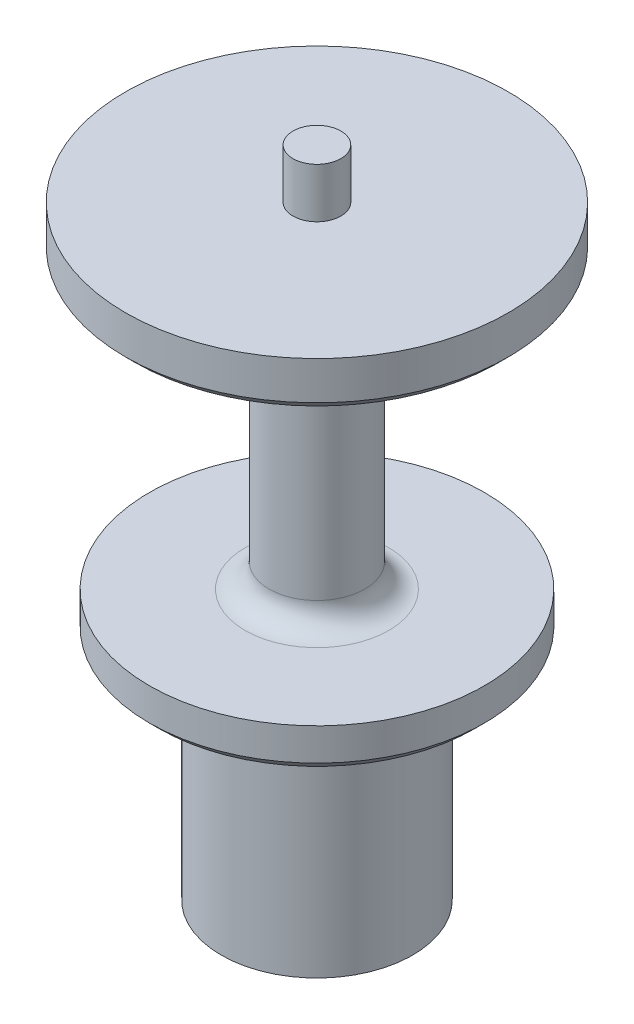
ISO-10303-21;
HEADER;
FILE_DESCRIPTION(('STEP AP214'),'2;1');
FILE_NAME('part.step','',(''),(''),'','','');
FILE_SCHEMA(('AUTOMOTIVE_DESIGN { 1 0 10303 214 1 1 1 1 }'));
ENDSEC;
DATA;
#1=APPLICATION_CONTEXT('core data for automotive mechanical design processes');
#2=APPLICATION_PROTOCOL_DEFINITION('international standard','automotive_design',2000,#1);
#3=PRODUCT_CONTEXT('',#1,'mechanical');
#4=PRODUCT('Part','Part','',(#3));
#5=PRODUCT_RELATED_PRODUCT_CATEGORY('part','',(#4));
#6=PRODUCT_DEFINITION_FORMATION('','',#4);
#7=PRODUCT_DEFINITION_CONTEXT('part definition',#1,'design');
#8=PRODUCT_DEFINITION('design','',#6,#7);
#9=PRODUCT_DEFINITION_SHAPE('','',#8);
#10=(LENGTH_UNIT() NAMED_UNIT(*) SI_UNIT(.MILLI.,.METRE.));
#11=(NAMED_UNIT(*) PLANE_ANGLE_UNIT() SI_UNIT($,.RADIAN.));
#12=(NAMED_UNIT(*) SI_UNIT($,.STERADIAN.) SOLID_ANGLE_UNIT());
#13=UNCERTAINTY_MEASURE_WITH_UNIT(LENGTH_MEASURE(1.E-05),#10,'distance_accuracy_value','');
#14=(GEOMETRIC_REPRESENTATION_CONTEXT(3) GLOBAL_UNCERTAINTY_ASSIGNED_CONTEXT((#13)) GLOBAL_UNIT_ASSIGNED_CONTEXT((#10,
#11,#12)) REPRESENTATION_CONTEXT('',''));
#15=CARTESIAN_POINT('',(0.,0.,0.));
#16=DIRECTION('',(0.,0.,1.));
#17=DIRECTION('',(1.,0.,0.));
#18=AXIS2_PLACEMENT_3D('',#15,#16,#17);
#19=CARTESIAN_POINT('',(0.,30.1625,0.));
#20=DIRECTION('',(0.,1.,0.));
#21=DIRECTION('',(0.,0.,1.));
#22=AXIS2_PLACEMENT_3D('',#19,#20,#21);
#23=PLANE('',#22);
#24=CARTESIAN_POINT('',(0.,30.1625,0.));
#25=DIRECTION('',(0.,1.,0.));
#26=DIRECTION('',(0.,0.,1.));
#27=AXIS2_PLACEMENT_3D('',#24,#25,#26);
#28=CIRCLE('',#27,20.955);
#29=CARTESIAN_POINT('',(0.,30.1625,20.955));
#30=VERTEX_POINT('',#29);
#31=EDGE_CURVE('E359',#30,#30,#28,.F.);
#32=ORIENTED_EDGE('',*,*,#31,.T.);
#33=EDGE_LOOP('',(#32));
#34=FACE_BOUND('',#33,.T.);
#35=CARTESIAN_POINT('',(0.,30.1625,0.));
#36=DIRECTION('',(0.,1.,0.));
#37=DIRECTION('',(0.,0.,1.));
#38=AXIS2_PLACEMENT_3D('',#35,#36,#37);
#39=CIRCLE('',#38,12.7);
#40=CARTESIAN_POINT('',(0.,30.1625,12.7));
#41=VERTEX_POINT('',#40);
#42=EDGE_CURVE('E342',#41,#41,#39,.T.);
#43=ORIENTED_EDGE('',*,*,#42,.T.);
#44=EDGE_LOOP('',(#43));
#45=FACE_BOUND('',#44,.T.);
#46=ADVANCED_FACE('F35',(#34,#45),#23,.F.);
#47=CARTESIAN_POINT('',(0.,0.,0.));
#48=DIRECTION('',(0.,1.,0.));
#49=DIRECTION('',(0.,0.,1.));
#50=AXIS2_PLACEMENT_3D('',#47,#48,#49);
#51=PLANE('',#50);
#52=CARTESIAN_POINT('',(0.,0.,0.));
#53=DIRECTION('',(0.,1.,0.));
#54=DIRECTION('',(0.,0.,1.));
#55=AXIS2_PLACEMENT_3D('',#52,#53,#54);
#56=CIRCLE('',#55,12.7);
#57=CARTESIAN_POINT('',(0.,0.,12.7));
#58=VERTEX_POINT('',#57);
#59=EDGE_CURVE('E341',#58,#58,#56,.T.);
#60=ORIENTED_EDGE('',*,*,#59,.F.);
#61=EDGE_LOOP('',(#60));
#62=FACE_BOUND('',#61,.T.);
#63=DIRECTION('',(0.707106781186548,0.,0.707106781186547));
#64=VECTOR('',#63,1.);
#65=CARTESIAN_POINT('',(-4.94974746830584,0.,4.94974746830584));
#66=LINE('',#65,#64);
#67=CARTESIAN_POINT('',(-8.77696292147802,0.,1.12253201513365));
#68=VERTEX_POINT('',#67);
#69=CARTESIAN_POINT('',(-7.,0.,2.89949493661167));
#70=VERTEX_POINT('',#69);
#71=EDGE_CURVE('E50',#68,#70,#66,.T.);
#72=ORIENTED_EDGE('',*,*,#71,.T.);
#73=DIRECTION('',(0.,0.,1.));
#74=VECTOR('',#73,1.);
#75=CARTESIAN_POINT('',(-7.,0.,0.));
#76=LINE('',#75,#74);
#77=CARTESIAN_POINT('',(-7.,0.,5.4125));
#78=VERTEX_POINT('',#77);
#79=EDGE_CURVE('E136',#70,#78,#76,.T.);
#80=ORIENTED_EDGE('',*,*,#79,.T.);
#81=CARTESIAN_POINT('',(-5.4125,0.,5.4125));
#82=DIRECTION('',(0.,-1.,0.));
#83=DIRECTION('',(0.,0.,-1.));
#84=AXIS2_PLACEMENT_3D('',#81,#82,#83);
#85=CIRCLE('',#84,1.5875);
#86=CARTESIAN_POINT('',(-5.4125,0.,7.));
#87=VERTEX_POINT('',#86);
#88=EDGE_CURVE('E291',#87,#78,#85,.T.);
#89=ORIENTED_EDGE('',*,*,#88,.F.);
#90=DIRECTION('',(1.,0.,0.));
#91=VECTOR('',#90,1.);
#92=CARTESIAN_POINT('',(0.,0.,7.));
#93=LINE('',#92,#91);
#94=CARTESIAN_POINT('',(-2.89949493661167,0.,7.));
#95=VERTEX_POINT('',#94);
#96=EDGE_CURVE('E208',#87,#95,#93,.T.);
#97=ORIENTED_EDGE('',*,*,#96,.T.);
#98=DIRECTION('',(0.707106781186548,0.,0.707106781186547));
#99=VECTOR('',#98,1.);
#100=CARTESIAN_POINT('',(-4.94974746830584,0.,4.94974746830584));
#101=LINE('',#100,#99);
#102=CARTESIAN_POINT('',(-1.12253201513365,0.,8.77696292147802));
#103=VERTEX_POINT('',#102);
#104=EDGE_CURVE('E287',#95,#103,#101,.T.);
#105=ORIENTED_EDGE('',*,*,#104,.T.);
#106=CARTESIAN_POINT('',(0.,0.,7.65443090634438));
#107=DIRECTION('',(0.,-1.,0.));
#108=DIRECTION('',(0.,0.,-1.));
#109=AXIS2_PLACEMENT_3D('',#106,#107,#108);
#110=CIRCLE('',#109,1.5875);
#111=CARTESIAN_POINT('',(1.12253201513365,0.,8.77696292147801));
#112=VERTEX_POINT('',#111);
#113=EDGE_CURVE('E284',#112,#103,#110,.T.);
#114=ORIENTED_EDGE('',*,*,#113,.F.);
#115=DIRECTION('',(0.707106781186548,0.,-0.707106781186548));
#116=VECTOR('',#115,1.);
#117=CARTESIAN_POINT('',(4.94974746830583,0.,4.94974746830583));
#118=LINE('',#117,#116);
#119=CARTESIAN_POINT('',(2.89949493661166,0.,7.));
#120=VERTEX_POINT('',#119);
#121=EDGE_CURVE('E281',#112,#120,#118,.T.);
#122=ORIENTED_EDGE('',*,*,#121,.T.);
#123=DIRECTION('',(1.,0.,0.));
#124=VECTOR('',#123,1.);
#125=CARTESIAN_POINT('',(0.,0.,7.));
#126=LINE('',#125,#124);
#127=CARTESIAN_POINT('',(5.4125,0.,7.));
#128=VERTEX_POINT('',#127);
#129=EDGE_CURVE('E278',#120,#128,#126,.T.);
#130=ORIENTED_EDGE('',*,*,#129,.T.);
#131=CARTESIAN_POINT('',(5.4125,0.,5.4125));
#132=DIRECTION('',(0.,-1.,0.));
#133=DIRECTION('',(0.,0.,-1.));
#134=AXIS2_PLACEMENT_3D('',#131,#132,#133);
#135=CIRCLE('',#134,1.5875);
#136=CARTESIAN_POINT('',(7.,0.,5.4125));
#137=VERTEX_POINT('',#136);
#138=EDGE_CURVE('E275',#137,#128,#135,.T.);
#139=ORIENTED_EDGE('',*,*,#138,.F.);
#140=DIRECTION('',(0.,0.,1.));
#141=VECTOR('',#140,1.);
#142=CARTESIAN_POINT('',(7.,0.,0.));
#143=LINE('',#142,#141);
#144=CARTESIAN_POINT('',(7.,0.,2.89949493661167));
#145=VERTEX_POINT('',#144);
#146=EDGE_CURVE('E272',#145,#137,#143,.T.);
#147=ORIENTED_EDGE('',*,*,#146,.F.);
#148=DIRECTION('',(0.707106781186548,0.,-0.707106781186548));
#149=VECTOR('',#148,1.);
#150=CARTESIAN_POINT('',(4.94974746830583,0.,4.94974746830583));
#151=LINE('',#150,#149);
#152=CARTESIAN_POINT('',(8.77696292147802,0.,1.12253201513365));
#153=VERTEX_POINT('',#152);
#154=EDGE_CURVE('E269',#145,#153,#151,.T.);
#155=ORIENTED_EDGE('',*,*,#154,.T.);
#156=CARTESIAN_POINT('',(7.65443090634438,0.,0.));
#157=DIRECTION('',(0.,-1.,0.));
#158=DIRECTION('',(0.,0.,-1.));
#159=AXIS2_PLACEMENT_3D('',#156,#157,#158);
#160=CIRCLE('',#159,1.5875);
#161=CARTESIAN_POINT('',(8.77696292147801,0.,-1.12253201513364));
#162=VERTEX_POINT('',#161);
#163=EDGE_CURVE('E266',#162,#153,#160,.T.);
#164=ORIENTED_EDGE('',*,*,#163,.F.);
#165=DIRECTION('',(0.707106781186548,0.,0.707106781186548));
#166=VECTOR('',#165,1.);
#167=CARTESIAN_POINT('',(4.94974746830583,0.,-4.94974746830583));
#168=LINE('',#167,#166);
#169=CARTESIAN_POINT('',(7.,0.,-2.89949493661165));
#170=VERTEX_POINT('',#169);
#171=EDGE_CURVE('E263',#170,#162,#168,.T.);
#172=ORIENTED_EDGE('',*,*,#171,.F.);
#173=DIRECTION('',(0.,0.,1.));
#174=VECTOR('',#173,1.);
#175=CARTESIAN_POINT('',(7.,0.,0.));
#176=LINE('',#175,#174);
#177=CARTESIAN_POINT('',(7.,0.,-5.4125));
#178=VERTEX_POINT('',#177);
#179=EDGE_CURVE('E260',#178,#170,#176,.T.);
#180=ORIENTED_EDGE('',*,*,#179,.F.);
#181=CARTESIAN_POINT('',(5.4125,0.,-5.4125));
#182=DIRECTION('',(0.,-1.,0.));
#183=DIRECTION('',(0.,0.,-1.));
#184=AXIS2_PLACEMENT_3D('',#181,#182,#183);
#185=CIRCLE('',#184,1.5875);
#186=CARTESIAN_POINT('',(5.4125,0.,-7.));
#187=VERTEX_POINT('',#186);
#188=EDGE_CURVE('E257',#187,#178,#185,.T.);
#189=ORIENTED_EDGE('',*,*,#188,.F.);
#190=DIRECTION('',(1.,0.,0.));
#191=VECTOR('',#190,1.);
#192=CARTESIAN_POINT('',(0.,0.,-7.));
#193=LINE('',#192,#191);
#194=CARTESIAN_POINT('',(2.89949493661166,0.,-7.));
#195=VERTEX_POINT('',#194);
#196=EDGE_CURVE('E254',#195,#187,#193,.T.);
#197=ORIENTED_EDGE('',*,*,#196,.F.);
#198=DIRECTION('',(0.707106781186548,0.,0.707106781186548));
#199=VECTOR('',#198,1.);
#200=CARTESIAN_POINT('',(4.94974746830583,0.,-4.94974746830583));
#201=LINE('',#200,#199);
#202=CARTESIAN_POINT('',(1.12253201513364,0.,-8.77696292147802));
#203=VERTEX_POINT('',#202);
#204=EDGE_CURVE('E251',#203,#195,#201,.T.);
#205=ORIENTED_EDGE('',*,*,#204,.F.);
#206=CARTESIAN_POINT('',(0.,0.,-7.65443090634438));
#207=DIRECTION('',(0.,-1.,0.));
#208=DIRECTION('',(0.,0.,-1.));
#209=AXIS2_PLACEMENT_3D('',#206,#207,#208);
#210=CIRCLE('',#209,1.5875);
#211=CARTESIAN_POINT('',(-1.12253201513365,0.,-8.77696292147802));
#212=VERTEX_POINT('',#211);
#213=EDGE_CURVE('E248',#212,#203,#210,.T.);
#214=ORIENTED_EDGE('',*,*,#213,.F.);
#215=DIRECTION('',(0.707106781186547,0.,-0.707106781186548));
#216=VECTOR('',#215,1.);
#217=CARTESIAN_POINT('',(-4.94974746830583,0.,-4.94974746830583));
#218=LINE('',#217,#216);
#219=CARTESIAN_POINT('',(-2.89949493661167,0.,-7.));
#220=VERTEX_POINT('',#219);
#221=EDGE_CURVE('E245',#220,#212,#218,.T.);
#222=ORIENTED_EDGE('',*,*,#221,.F.);
#223=DIRECTION('',(1.,0.,0.));
#224=VECTOR('',#223,1.);
#225=CARTESIAN_POINT('',(0.,0.,-7.));
#226=LINE('',#225,#224);
#227=CARTESIAN_POINT('',(-5.4125,0.,-7.));
#228=VERTEX_POINT('',#227);
#229=EDGE_CURVE('E242',#228,#220,#226,.T.);
#230=ORIENTED_EDGE('',*,*,#229,.F.);
#231=CARTESIAN_POINT('',(-5.4125,0.,-5.4125));
#232=DIRECTION('',(0.,-1.,0.));
#233=DIRECTION('',(0.,0.,-1.));
#234=AXIS2_PLACEMENT_3D('',#231,#232,#233);
#235=CIRCLE('',#234,1.5875);
#236=CARTESIAN_POINT('',(-7.,0.,-5.4125));
#237=VERTEX_POINT('',#236);
#238=EDGE_CURVE('E239',#237,#228,#235,.T.);
#239=ORIENTED_EDGE('',*,*,#238,.F.);
#240=DIRECTION('',(0.,0.,1.));
#241=VECTOR('',#240,1.);
#242=CARTESIAN_POINT('',(-7.,0.,0.));
#243=LINE('',#242,#241);
#244=CARTESIAN_POINT('',(-7.,0.,-2.89949493661167));
#245=VERTEX_POINT('',#244);
#246=EDGE_CURVE('E236',#237,#245,#243,.T.);
#247=ORIENTED_EDGE('',*,*,#246,.T.);
#248=DIRECTION('',(0.707106781186547,0.,-0.707106781186548));
#249=VECTOR('',#248,1.);
#250=CARTESIAN_POINT('',(-4.94974746830583,0.,-4.94974746830583));
#251=LINE('',#250,#249);
#252=CARTESIAN_POINT('',(-8.77696292147803,0.,-1.12253201513364));
#253=VERTEX_POINT('',#252);
#254=EDGE_CURVE('E233',#253,#245,#251,.T.);
#255=ORIENTED_EDGE('',*,*,#254,.F.);
#256=CARTESIAN_POINT('',(-7.65443090634438,0.,0.));
#257=DIRECTION('',(0.,-1.,0.));
#258=DIRECTION('',(0.,0.,-1.));
#259=AXIS2_PLACEMENT_3D('',#256,#257,#258);
#260=CIRCLE('',#259,1.5875);
#261=EDGE_CURVE('E229',#68,#253,#260,.T.);
#262=ORIENTED_EDGE('',*,*,#261,.F.);
#263=EDGE_LOOP('',(#72,#80,#89,#97,#105,#114,#122,#130,#139,#147,#155,#164,#172,#180,#189,#197,
#205,#214,#222,#230,#239,#247,#255,#262));
#264=FACE_BOUND('',#263,.T.);
#265=ADVANCED_FACE('F380',(#62,#264),#51,.F.);
#266=CARTESIAN_POINT('',(0.,30.1625,0.));
#267=DIRECTION('',(0.,-1.,0.));
#268=DIRECTION('',(0.,0.,-1.));
#269=AXIS2_PLACEMENT_3D('',#266,#267,#268);
#270=CYLINDRICAL_SURFACE('',#269,12.7);
#271=ORIENTED_EDGE('',*,*,#42,.F.);
#272=EDGE_LOOP('',(#271));
#273=FACE_BOUND('',#272,.T.);
#274=ORIENTED_EDGE('',*,*,#59,.T.);
#275=EDGE_LOOP('',(#274));
#276=FACE_BOUND('',#275,.T.);
#277=ADVANCED_FACE('F386',(#273,#276),#270,.T.);
#278=CARTESIAN_POINT('',(-4.94974746830584,11.176,4.94974746830584));
#279=DIRECTION('',(0.707106781186548,0.,-0.707106781186548));
#280=DIRECTION('',(-0.707106781186548,0.,-0.707106781186547));
#281=AXIS2_PLACEMENT_3D('',#278,#279,#280);
#282=PLANE('',#281);
#283=ORIENTED_EDGE('',*,*,#71,.F.);
#284=DIRECTION('',(0.,-1.,0.));
#285=VECTOR('',#284,1.);
#286=CARTESIAN_POINT('',(-8.77696292147802,11.176,1.12253201513365));
#287=LINE('',#286,#285);
#288=CARTESIAN_POINT('',(-8.77696292147802,11.176,1.12253201513365));
#289=VERTEX_POINT('',#288);
#290=EDGE_CURVE('E139',#289,#68,#287,.T.);
#291=ORIENTED_EDGE('',*,*,#290,.F.);
#292=DIRECTION('',(0.707106781186548,0.,0.707106781186547));
#293=VECTOR('',#292,1.);
#294=CARTESIAN_POINT('',(-4.94974746830584,11.176,4.94974746830584));
#295=LINE('',#294,#293);
#296=CARTESIAN_POINT('',(-7.,11.176,2.89949493661167));
#297=VERTEX_POINT('',#296);
#298=EDGE_CURVE('E294',#289,#297,#295,.T.);
#299=ORIENTED_EDGE('',*,*,#298,.T.);
#300=DIRECTION('',(0.,-1.,0.));
#301=VECTOR('',#300,1.);
#302=CARTESIAN_POINT('',(-7.,11.176,2.89949493661167));
#303=LINE('',#302,#301);
#304=EDGE_CURVE('E295',#297,#70,#303,.T.);
#305=ORIENTED_EDGE('',*,*,#304,.T.);
#306=EDGE_LOOP('',(#283,#291,#299,#305));
#307=FACE_BOUND('',#306,.T.);
#308=ADVANCED_FACE('F399',(#307),#282,.T.);
#309=CARTESIAN_POINT('',(-7.,11.176,0.));
#310=DIRECTION('',(1.,0.,0.));
#311=DIRECTION('',(0.,0.,-1.));
#312=AXIS2_PLACEMENT_3D('',#309,#310,#311);
#313=PLANE('',#312);
#314=ORIENTED_EDGE('',*,*,#79,.F.);
#315=ORIENTED_EDGE('',*,*,#304,.F.);
#316=DIRECTION('',(0.,0.,1.));
#317=VECTOR('',#316,1.);
#318=CARTESIAN_POINT('',(-7.,11.176,0.));
#319=LINE('',#318,#317);
#320=CARTESIAN_POINT('',(-7.,11.176,5.4125));
#321=VERTEX_POINT('',#320);
#322=EDGE_CURVE('E59',#297,#321,#319,.T.);
#323=ORIENTED_EDGE('',*,*,#322,.T.);
#324=DIRECTION('',(0.,-1.,0.));
#325=VECTOR('',#324,1.);
#326=CARTESIAN_POINT('',(-7.,11.176,5.4125));
#327=LINE('',#326,#325);
#328=EDGE_CURVE('E213',#321,#78,#327,.T.);
#329=ORIENTED_EDGE('',*,*,#328,.T.);
#330=EDGE_LOOP('',(#314,#315,#323,#329));
#331=FACE_BOUND('',#330,.T.);
#332=ADVANCED_FACE('F449',(#331),#313,.T.);
#333=CARTESIAN_POINT('',(-5.4125,11.176,5.4125));
#334=DIRECTION('',(0.,-1.,0.));
#335=DIRECTION('',(0.,0.,-1.));
#336=AXIS2_PLACEMENT_3D('',#333,#334,#335);
#337=CYLINDRICAL_SURFACE('',#336,1.5875);
#338=ORIENTED_EDGE('',*,*,#88,.T.);
#339=ORIENTED_EDGE('',*,*,#328,.F.);
#340=CARTESIAN_POINT('',(-5.4125,11.176,5.4125));
#341=DIRECTION('',(0.,-1.,0.));
#342=DIRECTION('',(0.,0.,-1.));
#343=AXIS2_PLACEMENT_3D('',#340,#341,#342);
#344=CIRCLE('',#343,1.5875);
#345=CARTESIAN_POINT('',(-5.4125,11.176,7.));
#346=VERTEX_POINT('',#345);
#347=EDGE_CURVE('E218',#346,#321,#344,.T.);
#348=ORIENTED_EDGE('',*,*,#347,.F.);
#349=DIRECTION('',(0.,-1.,0.));
#350=VECTOR('',#349,1.);
#351=CARTESIAN_POINT('',(-5.4125,11.176,7.));
#352=LINE('',#351,#350);
#353=EDGE_CURVE('E202',#346,#87,#352,.T.);
#354=ORIENTED_EDGE('',*,*,#353,.T.);
#355=EDGE_LOOP('',(#338,#339,#348,#354));
#356=FACE_BOUND('',#355,.T.);
#357=ADVANCED_FACE('F223',(#356),#337,.F.);
#358=CARTESIAN_POINT('',(0.,11.176,7.));
#359=DIRECTION('',(0.,0.,-1.));
#360=DIRECTION('',(-1.,0.,0.));
#361=AXIS2_PLACEMENT_3D('',#358,#359,#360);
#362=PLANE('',#361);
#363=ORIENTED_EDGE('',*,*,#96,.F.);
#364=ORIENTED_EDGE('',*,*,#353,.F.);
#365=DIRECTION('',(1.,0.,0.));
#366=VECTOR('',#365,1.);
#367=CARTESIAN_POINT('',(0.,11.176,7.));
#368=LINE('',#367,#366);
#369=CARTESIAN_POINT('',(-2.89949493661167,11.176,7.));
#370=VERTEX_POINT('',#369);
#371=EDGE_CURVE('E205',#346,#370,#368,.T.);
#372=ORIENTED_EDGE('',*,*,#371,.T.);
#373=DIRECTION('',(0.,-1.,0.));
#374=VECTOR('',#373,1.);
#375=CARTESIAN_POINT('',(-2.89949493661167,11.176,7.));
#376=LINE('',#375,#374);
#377=EDGE_CURVE('E214',#370,#95,#376,.T.);
#378=ORIENTED_EDGE('',*,*,#377,.T.);
#379=EDGE_LOOP('',(#363,#364,#372,#378));
#380=FACE_BOUND('',#379,.T.);
#381=ADVANCED_FACE('F204',(#380),#362,.T.);
#382=CARTESIAN_POINT('',(-4.94974746830584,11.176,4.94974746830584));
#383=DIRECTION('',(0.707106781186548,0.,-0.707106781186548));
#384=DIRECTION('',(-0.707106781186548,0.,-0.707106781186547));
#385=AXIS2_PLACEMENT_3D('',#382,#383,#384);
#386=PLANE('',#385);
#387=ORIENTED_EDGE('',*,*,#104,.F.);
#388=ORIENTED_EDGE('',*,*,#377,.F.);
#389=DIRECTION('',(0.707106781186548,0.,0.707106781186547));
#390=VECTOR('',#389,1.);
#391=CARTESIAN_POINT('',(-4.94974746830584,11.176,4.94974746830584));
#392=LINE('',#391,#390);
#393=CARTESIAN_POINT('',(-1.12253201513365,11.176,8.77696292147802));
#394=VERTEX_POINT('',#393);
#395=EDGE_CURVE('E220',#370,#394,#392,.T.);
#396=ORIENTED_EDGE('',*,*,#395,.T.);
#397=DIRECTION('',(0.,-1.,0.));
#398=VECTOR('',#397,1.);
#399=CARTESIAN_POINT('',(-1.12253201513365,11.176,8.77696292147802));
#400=LINE('',#399,#398);
#401=EDGE_CURVE('E300',#394,#103,#400,.T.);
#402=ORIENTED_EDGE('',*,*,#401,.T.);
#403=EDGE_LOOP('',(#387,#388,#396,#402));
#404=FACE_BOUND('',#403,.T.);
#405=ADVANCED_FACE('F456',(#404),#386,.T.);
#406=CARTESIAN_POINT('',(0.,11.176,7.65443090634438));
#407=DIRECTION('',(0.,-1.,0.));
#408=DIRECTION('',(0.,0.,-1.));
#409=AXIS2_PLACEMENT_3D('',#406,#407,#408);
#410=CYLINDRICAL_SURFACE('',#409,1.5875);
#411=ORIENTED_EDGE('',*,*,#113,.T.);
#412=ORIENTED_EDGE('',*,*,#401,.F.);
#413=CARTESIAN_POINT('',(0.,11.176,7.65443090634438));
#414=DIRECTION('',(0.,-1.,0.));
#415=DIRECTION('',(0.,0.,-1.));
#416=AXIS2_PLACEMENT_3D('',#413,#414,#415);
#417=CIRCLE('',#416,1.5875);
#418=CARTESIAN_POINT('',(1.12253201513365,11.176,8.77696292147801));
#419=VERTEX_POINT('',#418);
#420=EDGE_CURVE('E874',#419,#394,#417,.T.);
#421=ORIENTED_EDGE('',*,*,#420,.F.);
#422=DIRECTION('',(0.,-1.,0.));
#423=VECTOR('',#422,1.);
#424=CARTESIAN_POINT('',(1.12253201513365,11.176,8.77696292147801));
#425=LINE('',#424,#423);
#426=EDGE_CURVE('E302',#419,#112,#425,.T.);
#427=ORIENTED_EDGE('',*,*,#426,.T.);
#428=EDGE_LOOP('',(#411,#412,#421,#427));
#429=FACE_BOUND('',#428,.T.);
#430=ADVANCED_FACE('F459',(#429),#410,.F.);
#431=CARTESIAN_POINT('',(4.94974746830583,11.176,4.94974746830583));
#432=DIRECTION('',(-0.707106781186548,0.,-0.707106781186548));
#433=DIRECTION('',(-0.707106781186548,0.,0.707106781186548));
#434=AXIS2_PLACEMENT_3D('',#431,#432,#433);
#435=PLANE('',#434);
#436=ORIENTED_EDGE('',*,*,#121,.F.);
#437=ORIENTED_EDGE('',*,*,#426,.F.);
#438=DIRECTION('',(0.707106781186548,0.,-0.707106781186548));
#439=VECTOR('',#438,1.);
#440=CARTESIAN_POINT('',(4.94974746830583,11.176,4.94974746830583));
#441=LINE('',#440,#439);
#442=CARTESIAN_POINT('',(2.89949493661166,11.176,7.));
#443=VERTEX_POINT('',#442);
#444=EDGE_CURVE('E872',#419,#443,#441,.T.);
#445=ORIENTED_EDGE('',*,*,#444,.T.);
#446=DIRECTION('',(0.,-1.,0.));
#447=VECTOR('',#446,1.);
#448=CARTESIAN_POINT('',(2.89949493661166,11.176,7.));
#449=LINE('',#448,#447);
#450=EDGE_CURVE('E304',#443,#120,#449,.T.);
#451=ORIENTED_EDGE('',*,*,#450,.T.);
#452=EDGE_LOOP('',(#436,#437,#445,#451));
#453=FACE_BOUND('',#452,.T.);
#454=ADVANCED_FACE('F463',(#453),#435,.T.);
#455=CARTESIAN_POINT('',(0.,11.176,7.));
#456=DIRECTION('',(0.,0.,-1.));
#457=DIRECTION('',(-1.,0.,0.));
#458=AXIS2_PLACEMENT_3D('',#455,#456,#457);
#459=PLANE('',#458);
#460=ORIENTED_EDGE('',*,*,#129,.F.);
#461=ORIENTED_EDGE('',*,*,#450,.F.);
#462=DIRECTION('',(1.,0.,0.));
#463=VECTOR('',#462,1.);
#464=CARTESIAN_POINT('',(0.,11.176,7.));
#465=LINE('',#464,#463);
#466=CARTESIAN_POINT('',(5.4125,11.176,7.));
#467=VERTEX_POINT('',#466);
#468=EDGE_CURVE('E870',#443,#467,#465,.T.);
#469=ORIENTED_EDGE('',*,*,#468,.T.);
#470=DIRECTION('',(0.,-1.,0.));
#471=VECTOR('',#470,1.);
#472=CARTESIAN_POINT('',(5.4125,11.176,7.));
#473=LINE('',#472,#471);
#474=EDGE_CURVE('E306',#467,#128,#473,.T.);
#475=ORIENTED_EDGE('',*,*,#474,.T.);
#476=EDGE_LOOP('',(#460,#461,#469,#475));
#477=FACE_BOUND('',#476,.T.);
#478=ADVANCED_FACE('F467',(#477),#459,.T.);
#479=CARTESIAN_POINT('',(5.4125,11.176,5.4125));
#480=DIRECTION('',(0.,-1.,0.));
#481=DIRECTION('',(0.,0.,-1.));
#482=AXIS2_PLACEMENT_3D('',#479,#480,#481);
#483=CYLINDRICAL_SURFACE('',#482,1.5875);
#484=ORIENTED_EDGE('',*,*,#138,.T.);
#485=ORIENTED_EDGE('',*,*,#474,.F.);
#486=CARTESIAN_POINT('',(5.4125,11.176,5.4125));
#487=DIRECTION('',(0.,-1.,0.));
#488=DIRECTION('',(0.,0.,-1.));
#489=AXIS2_PLACEMENT_3D('',#486,#487,#488);
#490=CIRCLE('',#489,1.5875);
#491=CARTESIAN_POINT('',(7.,11.176,5.4125));
#492=VERTEX_POINT('',#491);
#493=EDGE_CURVE('E867',#492,#467,#490,.T.);
#494=ORIENTED_EDGE('',*,*,#493,.F.);
#495=DIRECTION('',(0.,-1.,0.));
#496=VECTOR('',#495,1.);
#497=CARTESIAN_POINT('',(7.,11.176,5.4125));
#498=LINE('',#497,#496);
#499=EDGE_CURVE('E308',#492,#137,#498,.T.);
#500=ORIENTED_EDGE('',*,*,#499,.T.);
#501=EDGE_LOOP('',(#484,#485,#494,#500));
#502=FACE_BOUND('',#501,.T.);
#503=ADVANCED_FACE('F471',(#502),#483,.F.);
#504=CARTESIAN_POINT('',(7.,11.176,0.));
#505=DIRECTION('',(1.,0.,0.));
#506=DIRECTION('',(0.,0.,-1.));
#507=AXIS2_PLACEMENT_3D('',#504,#505,#506);
#508=PLANE('',#507);
#509=ORIENTED_EDGE('',*,*,#146,.T.);
#510=ORIENTED_EDGE('',*,*,#499,.F.);
#511=DIRECTION('',(0.,0.,1.));
#512=VECTOR('',#511,1.);
#513=CARTESIAN_POINT('',(7.,11.176,0.));
#514=LINE('',#513,#512);
#515=CARTESIAN_POINT('',(7.,11.176,2.89949493661167));
#516=VERTEX_POINT('',#515);
#517=EDGE_CURVE('E864',#516,#492,#514,.T.);
#518=ORIENTED_EDGE('',*,*,#517,.F.);
#519=DIRECTION('',(0.,-1.,0.));
#520=VECTOR('',#519,1.);
#521=CARTESIAN_POINT('',(7.,11.176,2.89949493661167));
#522=LINE('',#521,#520);
#523=EDGE_CURVE('E310',#516,#145,#522,.T.);
#524=ORIENTED_EDGE('',*,*,#523,.T.);
#525=EDGE_LOOP('',(#509,#510,#518,#524));
#526=FACE_BOUND('',#525,.T.);
#527=ADVANCED_FACE('F475',(#526),#508,.F.);
#528=CARTESIAN_POINT('',(4.94974746830583,11.176,4.94974746830583));
#529=DIRECTION('',(-0.707106781186548,0.,-0.707106781186548));
#530=DIRECTION('',(-0.707106781186548,0.,0.707106781186548));
#531=AXIS2_PLACEMENT_3D('',#528,#529,#530);
#532=PLANE('',#531);
#533=ORIENTED_EDGE('',*,*,#154,.F.);
#534=ORIENTED_EDGE('',*,*,#523,.F.);
#535=DIRECTION('',(0.707106781186548,0.,-0.707106781186548));
#536=VECTOR('',#535,1.);
#537=CARTESIAN_POINT('',(4.94974746830583,11.176,4.94974746830583));
#538=LINE('',#537,#536);
#539=CARTESIAN_POINT('',(8.77696292147802,11.176,1.12253201513365));
#540=VERTEX_POINT('',#539);
#541=EDGE_CURVE('E862',#516,#540,#538,.T.);
#542=ORIENTED_EDGE('',*,*,#541,.T.);
#543=DIRECTION('',(0.,-1.,0.));
#544=VECTOR('',#543,1.);
#545=CARTESIAN_POINT('',(8.77696292147802,11.176,1.12253201513365));
#546=LINE('',#545,#544);
#547=EDGE_CURVE('E312',#540,#153,#546,.T.);
#548=ORIENTED_EDGE('',*,*,#547,.T.);
#549=EDGE_LOOP('',(#533,#534,#542,#548));
#550=FACE_BOUND('',#549,.T.);
#551=ADVANCED_FACE('F479',(#550),#532,.T.);
#552=CARTESIAN_POINT('',(7.65443090634438,11.176,0.));
#553=DIRECTION('',(0.,-1.,0.));
#554=DIRECTION('',(0.,0.,-1.));
#555=AXIS2_PLACEMENT_3D('',#552,#553,#554);
#556=CYLINDRICAL_SURFACE('',#555,1.5875);
#557=ORIENTED_EDGE('',*,*,#163,.T.);
#558=ORIENTED_EDGE('',*,*,#547,.F.);
#559=CARTESIAN_POINT('',(7.65443090634438,11.176,0.));
#560=DIRECTION('',(0.,-1.,0.));
#561=DIRECTION('',(0.,0.,-1.));
#562=AXIS2_PLACEMENT_3D('',#559,#560,#561);
#563=CIRCLE('',#562,1.5875);
#564=CARTESIAN_POINT('',(8.77696292147801,11.176,-1.12253201513364));
#565=VERTEX_POINT('',#564);
#566=EDGE_CURVE('E859',#565,#540,#563,.T.);
#567=ORIENTED_EDGE('',*,*,#566,.F.);
#568=DIRECTION('',(0.,-1.,0.));
#569=VECTOR('',#568,1.);
#570=CARTESIAN_POINT('',(8.77696292147801,11.176,-1.12253201513364));
#571=LINE('',#570,#569);
#572=EDGE_CURVE('E314',#565,#162,#571,.T.);
#573=ORIENTED_EDGE('',*,*,#572,.T.);
#574=EDGE_LOOP('',(#557,#558,#567,#573));
#575=FACE_BOUND('',#574,.T.);
#576=ADVANCED_FACE('F483',(#575),#556,.F.);
#577=CARTESIAN_POINT('',(4.94974746830583,11.176,-4.94974746830583));
#578=DIRECTION('',(0.707106781186548,0.,-0.707106781186548));
#579=DIRECTION('',(-0.707106781186548,0.,-0.707106781186548));
#580=AXIS2_PLACEMENT_3D('',#577,#578,#579);
#581=PLANE('',#580);
#582=ORIENTED_EDGE('',*,*,#171,.T.);
#583=ORIENTED_EDGE('',*,*,#572,.F.);
#584=DIRECTION('',(0.707106781186548,0.,0.707106781186548));
#585=VECTOR('',#584,1.);
#586=CARTESIAN_POINT('',(4.94974746830583,11.176,-4.94974746830583));
#587=LINE('',#586,#585);
#588=CARTESIAN_POINT('',(7.,11.176,-2.89949493661165));
#589=VERTEX_POINT('',#588);
#590=EDGE_CURVE('E856',#589,#565,#587,.T.);
#591=ORIENTED_EDGE('',*,*,#590,.F.);
#592=DIRECTION('',(0.,-1.,0.));
#593=VECTOR('',#592,1.);
#594=CARTESIAN_POINT('',(7.,11.176,-2.89949493661165));
#595=LINE('',#594,#593);
#596=EDGE_CURVE('E316',#589,#170,#595,.T.);
#597=ORIENTED_EDGE('',*,*,#596,.T.);
#598=EDGE_LOOP('',(#582,#583,#591,#597));
#599=FACE_BOUND('',#598,.T.);
#600=ADVANCED_FACE('F487',(#599),#581,.F.);
#601=CARTESIAN_POINT('',(7.,11.176,0.));
#602=DIRECTION('',(1.,0.,0.));
#603=DIRECTION('',(0.,0.,-1.));
#604=AXIS2_PLACEMENT_3D('',#601,#602,#603);
#605=PLANE('',#604);
#606=ORIENTED_EDGE('',*,*,#179,.T.);
#607=ORIENTED_EDGE('',*,*,#596,.F.);
#608=DIRECTION('',(0.,0.,1.));
#609=VECTOR('',#608,1.);
#610=CARTESIAN_POINT('',(7.,11.176,0.));
#611=LINE('',#610,#609);
#612=CARTESIAN_POINT('',(7.,11.176,-5.4125));
#613=VERTEX_POINT('',#612);
#614=EDGE_CURVE('E853',#613,#589,#611,.T.);
#615=ORIENTED_EDGE('',*,*,#614,.F.);
#616=DIRECTION('',(0.,-1.,0.));
#617=VECTOR('',#616,1.);
#618=CARTESIAN_POINT('',(7.,11.176,-5.4125));
#619=LINE('',#618,#617);
#620=EDGE_CURVE('E318',#613,#178,#619,.T.);
#621=ORIENTED_EDGE('',*,*,#620,.T.);
#622=EDGE_LOOP('',(#606,#607,#615,#621));
#623=FACE_BOUND('',#622,.T.);
#624=ADVANCED_FACE('F491',(#623),#605,.F.);
#625=CARTESIAN_POINT('',(5.4125,11.176,-5.4125));
#626=DIRECTION('',(0.,-1.,0.));
#627=DIRECTION('',(0.,0.,-1.));
#628=AXIS2_PLACEMENT_3D('',#625,#626,#627);
#629=CYLINDRICAL_SURFACE('',#628,1.5875);
#630=ORIENTED_EDGE('',*,*,#188,.T.);
#631=ORIENTED_EDGE('',*,*,#620,.F.);
#632=CARTESIAN_POINT('',(5.4125,11.176,-5.4125));
#633=DIRECTION('',(0.,-1.,0.));
#634=DIRECTION('',(0.,0.,-1.));
#635=AXIS2_PLACEMENT_3D('',#632,#633,#634);
#636=CIRCLE('',#635,1.5875);
#637=CARTESIAN_POINT('',(5.4125,11.176,-7.));
#638=VERTEX_POINT('',#637);
#639=EDGE_CURVE('E850',#638,#613,#636,.T.);
#640=ORIENTED_EDGE('',*,*,#639,.F.);
#641=DIRECTION('',(0.,-1.,0.));
#642=VECTOR('',#641,1.);
#643=CARTESIAN_POINT('',(5.4125,11.176,-7.));
#644=LINE('',#643,#642);
#645=EDGE_CURVE('E320',#638,#187,#644,.T.);
#646=ORIENTED_EDGE('',*,*,#645,.T.);
#647=EDGE_LOOP('',(#630,#631,#640,#646));
#648=FACE_BOUND('',#647,.T.);
#649=ADVANCED_FACE('F495',(#648),#629,.F.);
#650=CARTESIAN_POINT('',(0.,11.176,-7.));
#651=DIRECTION('',(0.,0.,-1.));
#652=DIRECTION('',(-1.,0.,0.));
#653=AXIS2_PLACEMENT_3D('',#650,#651,#652);
#654=PLANE('',#653);
#655=ORIENTED_EDGE('',*,*,#196,.T.);
#656=ORIENTED_EDGE('',*,*,#645,.F.);
#657=DIRECTION('',(1.,0.,0.));
#658=VECTOR('',#657,1.);
#659=CARTESIAN_POINT('',(0.,11.176,-7.));
#660=LINE('',#659,#658);
#661=CARTESIAN_POINT('',(2.89949493661166,11.176,-7.));
#662=VERTEX_POINT('',#661);
#663=EDGE_CURVE('E847',#662,#638,#660,.T.);
#664=ORIENTED_EDGE('',*,*,#663,.F.);
#665=DIRECTION('',(0.,-1.,0.));
#666=VECTOR('',#665,1.);
#667=CARTESIAN_POINT('',(2.89949493661166,11.176,-7.));
#668=LINE('',#667,#666);
#669=EDGE_CURVE('E322',#662,#195,#668,.T.);
#670=ORIENTED_EDGE('',*,*,#669,.T.);
#671=EDGE_LOOP('',(#655,#656,#664,#670));
#672=FACE_BOUND('',#671,.T.);
#673=ADVANCED_FACE('F499',(#672),#654,.F.);
#674=CARTESIAN_POINT('',(4.94974746830583,11.176,-4.94974746830583));
#675=DIRECTION('',(0.707106781186548,0.,-0.707106781186548));
#676=DIRECTION('',(-0.707106781186548,0.,-0.707106781186548));
#677=AXIS2_PLACEMENT_3D('',#674,#675,#676);
#678=PLANE('',#677);
#679=ORIENTED_EDGE('',*,*,#204,.T.);
#680=ORIENTED_EDGE('',*,*,#669,.F.);
#681=DIRECTION('',(0.707106781186548,0.,0.707106781186548));
#682=VECTOR('',#681,1.);
#683=CARTESIAN_POINT('',(4.94974746830583,11.176,-4.94974746830583));
#684=LINE('',#683,#682);
#685=CARTESIAN_POINT('',(1.12253201513364,11.176,-8.77696292147802));
#686=VERTEX_POINT('',#685);
#687=EDGE_CURVE('E844',#686,#662,#684,.T.);
#688=ORIENTED_EDGE('',*,*,#687,.F.);
#689=DIRECTION('',(0.,-1.,0.));
#690=VECTOR('',#689,1.);
#691=CARTESIAN_POINT('',(1.12253201513364,11.176,-8.77696292147802));
#692=LINE('',#691,#690);
#693=EDGE_CURVE('E324',#686,#203,#692,.T.);
#694=ORIENTED_EDGE('',*,*,#693,.T.);
#695=EDGE_LOOP('',(#679,#680,#688,#694));
#696=FACE_BOUND('',#695,.T.);
#697=ADVANCED_FACE('F503',(#696),#678,.F.);
#698=CARTESIAN_POINT('',(0.,11.176,-7.65443090634438));
#699=DIRECTION('',(0.,-1.,0.));
#700=DIRECTION('',(0.,0.,-1.));
#701=AXIS2_PLACEMENT_3D('',#698,#699,#700);
#702=CYLINDRICAL_SURFACE('',#701,1.5875);
#703=ORIENTED_EDGE('',*,*,#213,.T.);
#704=ORIENTED_EDGE('',*,*,#693,.F.);
#705=CARTESIAN_POINT('',(0.,11.176,-7.65443090634438));
#706=DIRECTION('',(0.,-1.,0.));
#707=DIRECTION('',(0.,0.,-1.));
#708=AXIS2_PLACEMENT_3D('',#705,#706,#707);
#709=CIRCLE('',#708,1.5875);
#710=CARTESIAN_POINT('',(-1.12253201513365,11.176,-8.77696292147802));
#711=VERTEX_POINT('',#710);
#712=EDGE_CURVE('E841',#711,#686,#709,.T.);
#713=ORIENTED_EDGE('',*,*,#712,.F.);
#714=DIRECTION('',(0.,-1.,0.));
#715=VECTOR('',#714,1.);
#716=CARTESIAN_POINT('',(-1.12253201513365,11.176,-8.77696292147802));
#717=LINE('',#716,#715);
#718=EDGE_CURVE('E326',#711,#212,#717,.T.);
#719=ORIENTED_EDGE('',*,*,#718,.T.);
#720=EDGE_LOOP('',(#703,#704,#713,#719));
#721=FACE_BOUND('',#720,.T.);
#722=ADVANCED_FACE('F507',(#721),#702,.F.);
#723=CARTESIAN_POINT('',(-4.94974746830583,11.176,-4.94974746830583));
#724=DIRECTION('',(-0.707106781186548,0.,-0.707106781186548));
#725=DIRECTION('',(-0.707106781186547,0.,0.707106781186548));
#726=AXIS2_PLACEMENT_3D('',#723,#724,#725);
#727=PLANE('',#726);
#728=ORIENTED_EDGE('',*,*,#221,.T.);
#729=ORIENTED_EDGE('',*,*,#718,.F.);
#730=DIRECTION('',(0.707106781186547,0.,-0.707106781186548));
#731=VECTOR('',#730,1.);
#732=CARTESIAN_POINT('',(-4.94974746830583,11.176,-4.94974746830583));
#733=LINE('',#732,#731);
#734=CARTESIAN_POINT('',(-2.89949493661167,11.176,-7.));
#735=VERTEX_POINT('',#734);
#736=EDGE_CURVE('E838',#735,#711,#733,.T.);
#737=ORIENTED_EDGE('',*,*,#736,.F.);
#738=DIRECTION('',(0.,-1.,0.));
#739=VECTOR('',#738,1.);
#740=CARTESIAN_POINT('',(-2.89949493661167,11.176,-7.));
#741=LINE('',#740,#739);
#742=EDGE_CURVE('E328',#735,#220,#741,.T.);
#743=ORIENTED_EDGE('',*,*,#742,.T.);
#744=EDGE_LOOP('',(#728,#729,#737,#743));
#745=FACE_BOUND('',#744,.T.);
#746=ADVANCED_FACE('F511',(#745),#727,.F.);
#747=CARTESIAN_POINT('',(0.,11.176,-7.));
#748=DIRECTION('',(0.,0.,-1.));
#749=DIRECTION('',(-1.,0.,0.));
#750=AXIS2_PLACEMENT_3D('',#747,#748,#749);
#751=PLANE('',#750);
#752=ORIENTED_EDGE('',*,*,#229,.T.);
#753=ORIENTED_EDGE('',*,*,#742,.F.);
#754=DIRECTION('',(1.,0.,0.));
#755=VECTOR('',#754,1.);
#756=CARTESIAN_POINT('',(0.,11.176,-7.));
#757=LINE('',#756,#755);
#758=CARTESIAN_POINT('',(-5.4125,11.176,-7.));
#759=VERTEX_POINT('',#758);
#760=EDGE_CURVE('E835',#759,#735,#757,.T.);
#761=ORIENTED_EDGE('',*,*,#760,.F.);
#762=DIRECTION('',(0.,-1.,0.));
#763=VECTOR('',#762,1.);
#764=CARTESIAN_POINT('',(-5.4125,11.176,-7.));
#765=LINE('',#764,#763);
#766=EDGE_CURVE('E330',#759,#228,#765,.T.);
#767=ORIENTED_EDGE('',*,*,#766,.T.);
#768=EDGE_LOOP('',(#752,#753,#761,#767));
#769=FACE_BOUND('',#768,.T.);
#770=ADVANCED_FACE('F515',(#769),#751,.F.);
#771=CARTESIAN_POINT('',(-5.4125,11.176,-5.4125));
#772=DIRECTION('',(0.,-1.,0.));
#773=DIRECTION('',(0.,0.,-1.));
#774=AXIS2_PLACEMENT_3D('',#771,#772,#773);
#775=CYLINDRICAL_SURFACE('',#774,1.5875);
#776=ORIENTED_EDGE('',*,*,#238,.T.);
#777=ORIENTED_EDGE('',*,*,#766,.F.);
#778=CARTESIAN_POINT('',(-5.4125,11.176,-5.4125));
#779=DIRECTION('',(0.,-1.,0.));
#780=DIRECTION('',(0.,0.,-1.));
#781=AXIS2_PLACEMENT_3D('',#778,#779,#780);
#782=CIRCLE('',#781,1.5875);
#783=CARTESIAN_POINT('',(-7.,11.176,-5.4125));
#784=VERTEX_POINT('',#783);
#785=EDGE_CURVE('E832',#784,#759,#782,.T.);
#786=ORIENTED_EDGE('',*,*,#785,.F.);
#787=DIRECTION('',(0.,-1.,0.));
#788=VECTOR('',#787,1.);
#789=CARTESIAN_POINT('',(-7.,11.176,-5.4125));
#790=LINE('',#789,#788);
#791=EDGE_CURVE('E332',#784,#237,#790,.T.);
#792=ORIENTED_EDGE('',*,*,#791,.T.);
#793=EDGE_LOOP('',(#776,#777,#786,#792));
#794=FACE_BOUND('',#793,.T.);
#795=ADVANCED_FACE('F519',(#794),#775,.F.);
#796=CARTESIAN_POINT('',(-7.,11.176,0.));
#797=DIRECTION('',(1.,0.,0.));
#798=DIRECTION('',(0.,0.,-1.));
#799=AXIS2_PLACEMENT_3D('',#796,#797,#798);
#800=PLANE('',#799);
#801=ORIENTED_EDGE('',*,*,#246,.F.);
#802=ORIENTED_EDGE('',*,*,#791,.F.);
#803=DIRECTION('',(0.,0.,1.));
#804=VECTOR('',#803,1.);
#805=CARTESIAN_POINT('',(-7.,11.176,0.));
#806=LINE('',#805,#804);
#807=CARTESIAN_POINT('',(-7.,11.176,-2.89949493661167));
#808=VERTEX_POINT('',#807);
#809=EDGE_CURVE('E830',#784,#808,#806,.T.);
#810=ORIENTED_EDGE('',*,*,#809,.T.);
#811=DIRECTION('',(0.,-1.,0.));
#812=VECTOR('',#811,1.);
#813=CARTESIAN_POINT('',(-7.,11.176,-2.89949493661167));
#814=LINE('',#813,#812);
#815=EDGE_CURVE('E334',#808,#245,#814,.T.);
#816=ORIENTED_EDGE('',*,*,#815,.T.);
#817=EDGE_LOOP('',(#801,#802,#810,#816));
#818=FACE_BOUND('',#817,.T.);
#819=ADVANCED_FACE('F523',(#818),#800,.T.);
#820=CARTESIAN_POINT('',(-4.94974746830583,11.176,-4.94974746830583));
#821=DIRECTION('',(-0.707106781186548,0.,-0.707106781186548));
#822=DIRECTION('',(-0.707106781186547,0.,0.707106781186548));
#823=AXIS2_PLACEMENT_3D('',#820,#821,#822);
#824=PLANE('',#823);
#825=ORIENTED_EDGE('',*,*,#254,.T.);
#826=ORIENTED_EDGE('',*,*,#815,.F.);
#827=DIRECTION('',(0.707106781186547,0.,-0.707106781186548));
#828=VECTOR('',#827,1.);
#829=CARTESIAN_POINT('',(-4.94974746830583,11.176,-4.94974746830583));
#830=LINE('',#829,#828);
#831=CARTESIAN_POINT('',(-8.77696292147803,11.176,-1.12253201513364));
#832=VERTEX_POINT('',#831);
#833=EDGE_CURVE('E827',#832,#808,#830,.T.);
#834=ORIENTED_EDGE('',*,*,#833,.F.);
#835=DIRECTION('',(0.,-1.,0.));
#836=VECTOR('',#835,1.);
#837=CARTESIAN_POINT('',(-8.77696292147803,11.176,-1.12253201513364));
#838=LINE('',#837,#836);
#839=EDGE_CURVE('E336',#832,#253,#838,.T.);
#840=ORIENTED_EDGE('',*,*,#839,.T.);
#841=EDGE_LOOP('',(#825,#826,#834,#840));
#842=FACE_BOUND('',#841,.T.);
#843=ADVANCED_FACE('F527',(#842),#824,.F.);
#844=CARTESIAN_POINT('',(-7.65443090634438,11.176,0.));
#845=DIRECTION('',(0.,-1.,0.));
#846=DIRECTION('',(0.,0.,-1.));
#847=AXIS2_PLACEMENT_3D('',#844,#845,#846);
#848=CYLINDRICAL_SURFACE('',#847,1.5875);
#849=ORIENTED_EDGE('',*,*,#261,.T.);
#850=ORIENTED_EDGE('',*,*,#839,.F.);
#851=CARTESIAN_POINT('',(-7.65443090634438,11.176,0.));
#852=DIRECTION('',(0.,-1.,0.));
#853=DIRECTION('',(0.,0.,-1.));
#854=AXIS2_PLACEMENT_3D('',#851,#852,#853);
#855=CIRCLE('',#854,1.5875);
#856=EDGE_CURVE('E824',#289,#832,#855,.T.);
#857=ORIENTED_EDGE('',*,*,#856,.F.);
#858=ORIENTED_EDGE('',*,*,#290,.T.);
#859=EDGE_LOOP('',(#849,#850,#857,#858));
#860=FACE_BOUND('',#859,.T.);
#861=ADVANCED_FACE('F447',(#860),#848,.F.);
#862=CARTESIAN_POINT('',(0.,11.176,0.));
#863=DIRECTION('',(0.,-1.,0.));
#864=DIRECTION('',(0.,0.,-1.));
#865=AXIS2_PLACEMENT_3D('',#862,#863,#864);
#866=PLANE('',#865);
#867=CARTESIAN_POINT('',(0.,11.176,0.));
#868=DIRECTION('',(0.,-1.,0.));
#869=DIRECTION('',(0.,0.,-1.));
#870=AXIS2_PLACEMENT_3D('',#867,#868,#869);
#871=CIRCLE('',#870,6.);
#872=CARTESIAN_POINT('',(0.,11.176,-6.));
#873=VERTEX_POINT('',#872);
#874=EDGE_CURVE('E814',#873,#873,#871,.T.);
#875=ORIENTED_EDGE('',*,*,#874,.F.);
#876=EDGE_LOOP('',(#875));
#877=FACE_BOUND('',#876,.T.);
#878=ORIENTED_EDGE('',*,*,#298,.F.);
#879=ORIENTED_EDGE('',*,*,#856,.T.);
#880=ORIENTED_EDGE('',*,*,#833,.T.);
#881=ORIENTED_EDGE('',*,*,#809,.F.);
#882=ORIENTED_EDGE('',*,*,#785,.T.);
#883=ORIENTED_EDGE('',*,*,#760,.T.);
#884=ORIENTED_EDGE('',*,*,#736,.T.);
#885=ORIENTED_EDGE('',*,*,#712,.T.);
#886=ORIENTED_EDGE('',*,*,#687,.T.);
#887=ORIENTED_EDGE('',*,*,#663,.T.);
#888=ORIENTED_EDGE('',*,*,#639,.T.);
#889=ORIENTED_EDGE('',*,*,#614,.T.);
#890=ORIENTED_EDGE('',*,*,#590,.T.);
#891=ORIENTED_EDGE('',*,*,#566,.T.);
#892=ORIENTED_EDGE('',*,*,#541,.F.);
#893=ORIENTED_EDGE('',*,*,#517,.T.);
#894=ORIENTED_EDGE('',*,*,#493,.T.);
#895=ORIENTED_EDGE('',*,*,#468,.F.);
#896=ORIENTED_EDGE('',*,*,#444,.F.);
#897=ORIENTED_EDGE('',*,*,#420,.T.);
#898=ORIENTED_EDGE('',*,*,#395,.F.);
#899=ORIENTED_EDGE('',*,*,#371,.F.);
#900=ORIENTED_EDGE('',*,*,#347,.T.);
#901=ORIENTED_EDGE('',*,*,#322,.F.);
#902=EDGE_LOOP('',(#878,#879,#880,#881,#882,#883,#884,#885,#886,#887,#888,#889,#890,#891,#892,
#893,#894,#895,#896,#897,#898,#899,#900,#901));
#903=FACE_BOUND('',#902,.T.);
#904=ADVANCED_FACE('F217',(#877,#903),#866,.T.);
#905=CARTESIAN_POINT('',(0.,19.176,0.));
#906=DIRECTION('',(0.,-1.,0.));
#907=DIRECTION('',(0.,0.,-1.));
#908=AXIS2_PLACEMENT_3D('',#905,#906,#907);
#909=CYLINDRICAL_SURFACE('',#908,6.);
#910=CARTESIAN_POINT('',(0.,19.176,0.));
#911=DIRECTION('',(0.,-1.,0.));
#912=DIRECTION('',(0.,0.,-1.));
#913=AXIS2_PLACEMENT_3D('',#910,#911,#912);
#914=CIRCLE('',#913,6.);
#915=CARTESIAN_POINT('',(0.,19.176,-6.));
#916=VERTEX_POINT('',#915);
#917=EDGE_CURVE('E230',#916,#916,#914,.T.);
#918=ORIENTED_EDGE('',*,*,#917,.F.);
#919=EDGE_LOOP('',(#918));
#920=FACE_BOUND('',#919,.T.);
#921=ORIENTED_EDGE('',*,*,#874,.T.);
#922=EDGE_LOOP('',(#921));
#923=FACE_BOUND('',#922,.T.);
#924=ADVANCED_FACE('F440',(#920,#923),#909,.F.);
#925=CARTESIAN_POINT('',(0.,19.176,0.));
#926=DIRECTION('',(0.,-1.,0.));
#927=DIRECTION('',(0.,0.,-1.));
#928=AXIS2_PLACEMENT_3D('',#925,#926,#927);
#929=PLANE('',#928);
#930=ORIENTED_EDGE('',*,*,#917,.T.);
#931=EDGE_LOOP('',(#930));
#932=FACE_BOUND('',#931,.T.);
#933=ADVANCED_FACE('F437',(#932),#929,.T.);
#934=CARTESIAN_POINT('',(0.,86.77375,0.));
#935=DIRECTION('',(0.,-1.,0.));
#936=DIRECTION('',(0.,0.,-1.));
#937=AXIS2_PLACEMENT_3D('',#934,#935,#936);
#938=CYLINDRICAL_SURFACE('',#937,22.225);
#939=CARTESIAN_POINT('',(0.,31.4325,0.));
#940=DIRECTION('',(0.,1.,0.));
#941=DIRECTION('',(0.,0.,1.));
#942=AXIS2_PLACEMENT_3D('',#939,#940,#941);
#943=CIRCLE('',#942,22.225);
#944=CARTESIAN_POINT('',(0.,31.4325,22.225));
#945=VERTEX_POINT('',#944);
#946=EDGE_CURVE('E362',#945,#945,#943,.T.);
#947=ORIENTED_EDGE('',*,*,#946,.T.);
#948=EDGE_LOOP('',(#947));
#949=FACE_BOUND('',#948,.T.);
#950=CARTESIAN_POINT('',(0.,35.71875,0.));
#951=DIRECTION('',(0.,1.,0.));
#952=DIRECTION('',(0.,0.,1.));
#953=AXIS2_PLACEMENT_3D('',#950,#951,#952);
#954=CIRCLE('',#953,22.225);
#955=CARTESIAN_POINT('',(0.,35.71875,22.225));
#956=VERTEX_POINT('',#955);
#957=EDGE_CURVE('E811',#956,#956,#954,.F.);
#958=ORIENTED_EDGE('',*,*,#957,.T.);
#959=EDGE_LOOP('',(#958));
#960=FACE_BOUND('',#959,.T.);
#961=ADVANCED_FACE('F427',(#949,#960),#938,.T.);
#962=CARTESIAN_POINT('',(0.,86.77275,0.));
#963=DIRECTION('',(0.,1.,0.));
#964=DIRECTION('',(0.,0.,1.));
#965=AXIS2_PLACEMENT_3D('',#962,#963,#964);
#966=PLANE('',#965);
#967=CARTESIAN_POINT('',(0.,86.77275,0.));
#968=DIRECTION('',(0.,1.,0.));
#969=DIRECTION('',(0.,0.,1.));
#970=AXIS2_PLACEMENT_3D('',#967,#968,#969);
#971=CIRCLE('',#970,3.175);
#972=CARTESIAN_POINT('',(0.,86.77275,3.175));
#973=VERTEX_POINT('',#972);
#974=EDGE_CURVE('E810',#973,#973,#971,.T.);
#975=ORIENTED_EDGE('',*,*,#974,.T.);
#976=EDGE_LOOP('',(#975));
#977=FACE_BOUND('',#976,.T.);
#978=ADVANCED_FACE('F429',(#977),#966,.T.);
#979=CARTESIAN_POINT('',(0.,86.77275,0.));
#980=DIRECTION('',(0.,-1.,0.));
#981=DIRECTION('',(0.,0.,-1.));
#982=AXIS2_PLACEMENT_3D('',#979,#980,#981);
#983=CYLINDRICAL_SURFACE('',#982,3.175);
#984=ORIENTED_EDGE('',*,*,#974,.F.);
#985=EDGE_LOOP('',(#984));
#986=FACE_BOUND('',#985,.T.);
#987=CARTESIAN_POINT('',(0.,80.16875,0.));
#988=DIRECTION('',(0.,1.,0.));
#989=DIRECTION('',(0.,0.,1.));
#990=AXIS2_PLACEMENT_3D('',#987,#988,#989);
#991=CIRCLE('',#990,3.175);
#992=CARTESIAN_POINT('',(0.,80.16875,3.175));
#993=VERTEX_POINT('',#992);
#994=EDGE_CURVE('E807',#993,#993,#991,.T.);
#995=ORIENTED_EDGE('',*,*,#994,.T.);
#996=EDGE_LOOP('',(#995));
#997=FACE_BOUND('',#996,.T.);
#998=ADVANCED_FACE('F432',(#986,#997),#983,.T.);
#999=CARTESIAN_POINT('',(0.,80.16875,0.));
#1000=DIRECTION('',(0.,1.,0.));
#1001=DIRECTION('',(0.,0.,1.));
#1002=AXIS2_PLACEMENT_3D('',#999,#1000,#1001);
#1003=PLANE('',#1002);
#1004=ORIENTED_EDGE('',*,*,#994,.F.);
#1005=EDGE_LOOP('',(#1004));
#1006=FACE_BOUND('',#1005,.T.);
#1007=CARTESIAN_POINT('',(0.,80.16875,0.));
#1008=DIRECTION('',(0.,1.,0.));
#1009=DIRECTION('',(0.,0.,1.));
#1010=AXIS2_PLACEMENT_3D('',#1007,#1008,#1009);
#1011=CIRCLE('',#1010,25.4);
#1012=CARTESIAN_POINT('',(0.,80.16875,25.4));
#1013=VERTEX_POINT('',#1012);
#1014=EDGE_CURVE('E297',#1013,#1013,#1011,.T.);
#1015=ORIENTED_EDGE('',*,*,#1014,.T.);
#1016=EDGE_LOOP('',(#1015));
#1017=FACE_BOUND('',#1016,.T.);
#1018=ADVANCED_FACE('F392',(#1006,#1017),#1003,.T.);
#1019=CARTESIAN_POINT('',(0.,80.16875,0.));
#1020=DIRECTION('',(0.,-1.,0.));
#1021=DIRECTION('',(0.,0.,-1.));
#1022=AXIS2_PLACEMENT_3D('',#1019,#1020,#1021);
#1023=CYLINDRICAL_SURFACE('',#1022,25.4);
#1024=CARTESIAN_POINT('',(0.,75.08875,0.));
#1025=DIRECTION('',(0.,1.,0.));
#1026=DIRECTION('',(0.,0.,1.));
#1027=AXIS2_PLACEMENT_3D('',#1024,#1025,#1026);
#1028=CIRCLE('',#1027,25.4);
#1029=CARTESIAN_POINT('',(0.,75.08875,25.4));
#1030=VERTEX_POINT('',#1029);
#1031=EDGE_CURVE('E43',#1030,#1030,#1028,.T.);
#1032=ORIENTED_EDGE('',*,*,#1031,.T.);
#1033=EDGE_LOOP('',(#1032));
#1034=FACE_BOUND('',#1033,.T.);
#1035=ORIENTED_EDGE('',*,*,#1014,.F.);
#1036=EDGE_LOOP('',(#1035));
#1037=FACE_BOUND('',#1036,.T.);
#1038=ADVANCED_FACE('F367',(#1034,#1037),#1023,.T.);
#1039=CARTESIAN_POINT('',(0.,73.81875,0.));
#1040=DIRECTION('',(0.,1.,0.));
#1041=DIRECTION('',(0.,0.,1.));
#1042=AXIS2_PLACEMENT_3D('',#1039,#1040,#1041);
#1043=PLANE('',#1042);
#1044=CARTESIAN_POINT('',(0.,73.81875,0.));
#1045=DIRECTION('',(0.,1.,0.));
#1046=DIRECTION('',(0.,0.,1.));
#1047=AXIS2_PLACEMENT_3D('',#1044,#1045,#1046);
#1048=CIRCLE('',#1047,24.13);
#1049=CARTESIAN_POINT('',(0.,73.81875,24.13));
#1050=VERTEX_POINT('',#1049);
#1051=EDGE_CURVE('E11',#1050,#1050,#1048,.F.);
#1052=ORIENTED_EDGE('',*,*,#1051,.T.);
#1053=EDGE_LOOP('',(#1052));
#1054=FACE_BOUND('',#1053,.T.);
#1055=CARTESIAN_POINT('',(0.,73.81875,0.));
#1056=DIRECTION('',(0.,1.,0.));
#1057=DIRECTION('',(0.,0.,1.));
#1058=AXIS2_PLACEMENT_3D('',#1055,#1056,#1057);
#1059=CIRCLE('',#1058,9.525);
#1060=CARTESIAN_POINT('',(0.,73.81875,9.525));
#1061=VERTEX_POINT('',#1060);
#1062=EDGE_CURVE('E345',#1061,#1061,#1059,.T.);
#1063=ORIENTED_EDGE('',*,*,#1062,.T.);
#1064=EDGE_LOOP('',(#1063));
#1065=FACE_BOUND('',#1064,.T.);
#1066=ADVANCED_FACE('F395',(#1054,#1065),#1043,.F.);
#1067=CARTESIAN_POINT('',(0.,35.71875,0.));
#1068=DIRECTION('',(0.,1.,0.));
#1069=DIRECTION('',(0.,0.,1.));
#1070=AXIS2_PLACEMENT_3D('',#1067,#1068,#1069);
#1071=CYLINDRICAL_SURFACE('',#1070,6.35);
#1072=CARTESIAN_POINT('',(0.,70.64375,0.));
#1073=DIRECTION('',(0.,1.,0.));
#1074=DIRECTION('',(0.,0.,1.));
#1075=AXIS2_PLACEMENT_3D('',#1072,#1073,#1074);
#1076=CIRCLE('',#1075,6.35);
#1077=CARTESIAN_POINT('',(0.,70.64375,6.35));
#1078=VERTEX_POINT('',#1077);
#1079=EDGE_CURVE('E353',#1078,#1078,#1076,.F.);
#1080=ORIENTED_EDGE('',*,*,#1079,.T.);
#1081=EDGE_LOOP('',(#1080));
#1082=FACE_BOUND('',#1081,.T.);
#1083=CARTESIAN_POINT('',(0.,38.89375,0.));
#1084=DIRECTION('',(0.,1.,0.));
#1085=DIRECTION('',(0.,0.,1.));
#1086=AXIS2_PLACEMENT_3D('',#1083,#1084,#1085);
#1087=CIRCLE('',#1086,6.35);
#1088=CARTESIAN_POINT('',(0.,38.89375,6.35));
#1089=VERTEX_POINT('',#1088);
#1090=EDGE_CURVE('E350',#1089,#1089,#1087,.T.);
#1091=ORIENTED_EDGE('',*,*,#1090,.T.);
#1092=EDGE_LOOP('',(#1091));
#1093=FACE_BOUND('',#1092,.T.);
#1094=ADVANCED_FACE('F414',(#1082,#1093),#1071,.T.);
#1095=CARTESIAN_POINT('',(0.,35.71875,0.));
#1096=DIRECTION('',(0.,1.,0.));
#1097=DIRECTION('',(0.,0.,1.));
#1098=AXIS2_PLACEMENT_3D('',#1095,#1096,#1097);
#1099=PLANE('',#1098);
#1100=CARTESIAN_POINT('',(0.,35.71875,0.));
#1101=DIRECTION('',(0.,1.,0.));
#1102=DIRECTION('',(0.,0.,1.));
#1103=AXIS2_PLACEMENT_3D('',#1100,#1101,#1102);
#1104=CIRCLE('',#1103,9.525);
#1105=CARTESIAN_POINT('',(0.,35.71875,9.525));
#1106=VERTEX_POINT('',#1105);
#1107=EDGE_CURVE('E356',#1106,#1106,#1104,.F.);
#1108=ORIENTED_EDGE('',*,*,#1107,.T.);
#1109=EDGE_LOOP('',(#1108));
#1110=FACE_BOUND('',#1109,.T.);
#1111=ORIENTED_EDGE('',*,*,#957,.F.);
#1112=EDGE_LOOP('',(#1111));
#1113=FACE_BOUND('',#1112,.T.);
#1114=ADVANCED_FACE('F404',(#1110,#1113),#1099,.T.);
#1115=CARTESIAN_POINT('',(0.,70.64375,0.));
#1116=DIRECTION('',(0.,1.,0.));
#1117=DIRECTION('',(0.,0.,1.));
#1118=AXIS2_PLACEMENT_3D('',#1115,#1116,#1117);
#1119=TOROIDAL_SURFACE('',#1118,9.525,3.175);
#1120=ORIENTED_EDGE('',*,*,#1079,.F.);
#1121=EDGE_LOOP('',(#1120));
#1122=FACE_BOUND('',#1121,.T.);
#1123=ORIENTED_EDGE('',*,*,#1062,.F.);
#1124=EDGE_LOOP('',(#1123));
#1125=FACE_BOUND('',#1124,.T.);
#1126=ADVANCED_FACE('F401',(#1122,#1125),#1119,.F.);
#1127=CARTESIAN_POINT('',(0.,38.89375,0.));
#1128=DIRECTION('',(0.,1.,0.));
#1129=DIRECTION('',(0.,0.,1.));
#1130=AXIS2_PLACEMENT_3D('',#1127,#1128,#1129);
#1131=TOROIDAL_SURFACE('',#1130,9.525,3.175);
#1132=ORIENTED_EDGE('',*,*,#1107,.F.);
#1133=EDGE_LOOP('',(#1132));
#1134=FACE_BOUND('',#1133,.T.);
#1135=ORIENTED_EDGE('',*,*,#1090,.F.);
#1136=EDGE_LOOP('',(#1135));
#1137=FACE_BOUND('',#1136,.T.);
#1138=ADVANCED_FACE('F376',(#1134,#1137),#1131,.F.);
#1139=CARTESIAN_POINT('',(0.,30.1625,0.));
#1140=DIRECTION('',(0.,1.,0.));
#1141=DIRECTION('',(0.,0.,1.));
#1142=AXIS2_PLACEMENT_3D('',#1139,#1140,#1141);
#1143=CONICAL_SURFACE('',#1142,20.955,0.78539816339745);
#1144=ORIENTED_EDGE('',*,*,#946,.F.);
#1145=EDGE_LOOP('',(#1144));
#1146=FACE_BOUND('',#1145,.T.);
#1147=ORIENTED_EDGE('',*,*,#31,.F.);
#1148=EDGE_LOOP('',(#1147));
#1149=FACE_BOUND('',#1148,.T.);
#1150=ADVANCED_FACE('F371',(#1146,#1149),#1143,.T.);
#1151=CARTESIAN_POINT('',(0.,75.08875,0.));
#1152=DIRECTION('',(0.,1.,0.));
#1153=DIRECTION('',(0.,0.,1.));
#1154=AXIS2_PLACEMENT_3D('',#1151,#1152,#1153);
#1155=CONICAL_SURFACE('',#1154,25.4,0.78539816339745);
#1156=ORIENTED_EDGE('',*,*,#1051,.F.);
#1157=EDGE_LOOP('',(#1156));
#1158=FACE_BOUND('',#1157,.T.);
#1159=ORIENTED_EDGE('',*,*,#1031,.F.);
#1160=EDGE_LOOP('',(#1159));
#1161=FACE_BOUND('',#1160,.T.);
#1162=ADVANCED_FACE('F37',(#1158,#1161),#1155,.T.);
#1163=CLOSED_SHELL('',(#46,#265,#277,#308,#332,#357,#381,#405,#430,#454,#478,#503,#527,#551,
#576,#600,#624,#649,#673,#697,#722,#746,#770,#795,#819,#843,#861,#904,#924,#933,#961,#978,#998,
#1018,#1038,#1066,#1094,#1114,#1126,#1138,#1150,#1162));
#1164=MANIFOLD_SOLID_BREP('B2',#1163);
#1165=ADVANCED_BREP_SHAPE_REPRESENTATION('',(#18,#1164),#14);
#1166=SHAPE_DEFINITION_REPRESENTATION(#9,#1165);
ENDSEC;
END-ISO-10303-21;
